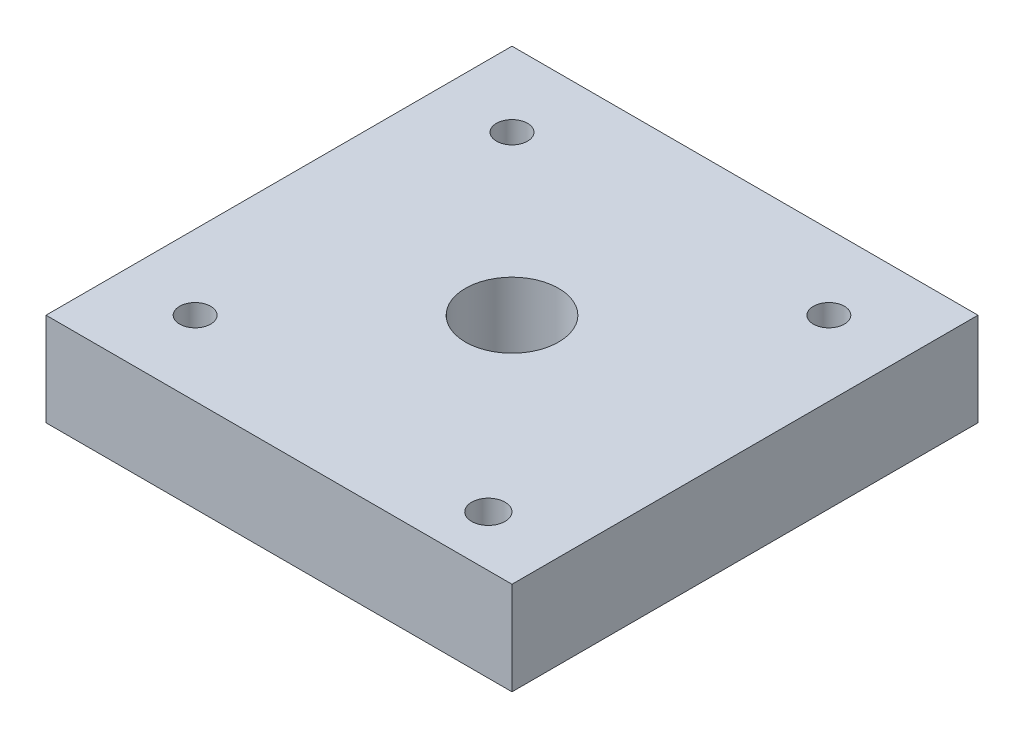
ISO-10303-21;
HEADER;
FILE_DESCRIPTION(('STEP AP214'),'2;1');
FILE_NAME('part.step','',(''),(''),'','','');
FILE_SCHEMA(('AUTOMOTIVE_DESIGN { 1 0 10303 214 1 1 1 1 }'));
ENDSEC;
DATA;
#1=APPLICATION_CONTEXT('core data for automotive mechanical design processes');
#2=APPLICATION_PROTOCOL_DEFINITION('international standard','automotive_design',2000,#1);
#3=PRODUCT_CONTEXT('',#1,'mechanical');
#4=PRODUCT('Part','Part','',(#3));
#5=PRODUCT_RELATED_PRODUCT_CATEGORY('part','',(#4));
#6=PRODUCT_DEFINITION_FORMATION('','',#4);
#7=PRODUCT_DEFINITION_CONTEXT('part definition',#1,'design');
#8=PRODUCT_DEFINITION('design','',#6,#7);
#9=PRODUCT_DEFINITION_SHAPE('','',#8);
#10=(LENGTH_UNIT() NAMED_UNIT(*) SI_UNIT(.MILLI.,.METRE.));
#11=(NAMED_UNIT(*) PLANE_ANGLE_UNIT() SI_UNIT($,.RADIAN.));
#12=(NAMED_UNIT(*) SI_UNIT($,.STERADIAN.) SOLID_ANGLE_UNIT());
#13=UNCERTAINTY_MEASURE_WITH_UNIT(LENGTH_MEASURE(1.E-05),#10,'distance_accuracy_value','');
#14=(GEOMETRIC_REPRESENTATION_CONTEXT(3) GLOBAL_UNCERTAINTY_ASSIGNED_CONTEXT((#13)) GLOBAL_UNIT_ASSIGNED_CONTEXT((#10,
#11,#12)) REPRESENTATION_CONTEXT('',''));
#15=CARTESIAN_POINT('',(0.,0.,0.));
#16=DIRECTION('',(0.,0.,1.));
#17=DIRECTION('',(1.,0.,0.));
#18=AXIS2_PLACEMENT_3D('',#15,#16,#17);
#19=CARTESIAN_POINT('',(0.,10.,0.));
#20=DIRECTION('',(0.,-1.,0.));
#21=DIRECTION('',(0.,0.,-1.));
#22=AXIS2_PLACEMENT_3D('',#19,#20,#21);
#23=PLANE('',#22);
#24=CARTESIAN_POINT('',(-17.,10.,17.));
#25=DIRECTION('',(0.,1.,0.));
#26=DIRECTION('',(0.,0.,1.));
#27=AXIS2_PLACEMENT_3D('',#24,#25,#26);
#28=CIRCLE('',#27,1.666);
#29=CARTESIAN_POINT('',(-17.,10.,18.666));
#30=VERTEX_POINT('',#29);
#31=EDGE_CURVE('E127',#30,#30,#28,.T.);
#32=ORIENTED_EDGE('',*,*,#31,.F.);
#33=EDGE_LOOP('',(#32));
#34=FACE_BOUND('',#33,.T.);
#35=CARTESIAN_POINT('',(-17.,10.,-17.));
#36=DIRECTION('',(0.,1.,0.));
#37=DIRECTION('',(0.,0.,1.));
#38=AXIS2_PLACEMENT_3D('',#35,#36,#37);
#39=CIRCLE('',#38,1.666);
#40=CARTESIAN_POINT('',(-17.,10.,-15.334));
#41=VERTEX_POINT('',#40);
#42=EDGE_CURVE('E115',#41,#41,#39,.T.);
#43=ORIENTED_EDGE('',*,*,#42,.F.);
#44=EDGE_LOOP('',(#43));
#45=FACE_BOUND('',#44,.T.);
#46=DIRECTION('',(0.,0.,-1.));
#47=VECTOR('',#46,1.);
#48=CARTESIAN_POINT('',(25.,10.,25.));
#49=LINE('',#48,#47);
#50=CARTESIAN_POINT('',(25.,10.,25.));
#51=VERTEX_POINT('',#50);
#52=CARTESIAN_POINT('',(25.,10.,-25.));
#53=VERTEX_POINT('',#52);
#54=EDGE_CURVE('E85',#51,#53,#49,.T.);
#55=ORIENTED_EDGE('',*,*,#54,.T.);
#56=DIRECTION('',(-1.,0.,0.));
#57=VECTOR('',#56,1.);
#58=CARTESIAN_POINT('',(-25.,10.,-25.));
#59=LINE('',#58,#57);
#60=CARTESIAN_POINT('',(-25.,10.,-25.));
#61=VERTEX_POINT('',#60);
#62=EDGE_CURVE('E80',#53,#61,#59,.T.);
#63=ORIENTED_EDGE('',*,*,#62,.T.);
#64=DIRECTION('',(0.,0.,1.));
#65=VECTOR('',#64,1.);
#66=CARTESIAN_POINT('',(-25.,10.,25.));
#67=LINE('',#66,#65);
#68=CARTESIAN_POINT('',(-25.,10.,25.));
#69=VERTEX_POINT('',#68);
#70=EDGE_CURVE('E83',#61,#69,#67,.T.);
#71=ORIENTED_EDGE('',*,*,#70,.T.);
#72=DIRECTION('',(1.,0.,0.));
#73=VECTOR('',#72,1.);
#74=CARTESIAN_POINT('',(-25.,10.,25.));
#75=LINE('',#74,#73);
#76=EDGE_CURVE('E50',#69,#51,#75,.T.);
#77=ORIENTED_EDGE('',*,*,#76,.T.);
#78=EDGE_LOOP('',(#55,#63,#71,#77));
#79=FACE_BOUND('',#78,.T.);
#80=CARTESIAN_POINT('',(0.,10.,0.));
#81=DIRECTION('',(0.,1.,0.));
#82=DIRECTION('',(0.,0.,1.));
#83=AXIS2_PLACEMENT_3D('',#80,#81,#82);
#84=CIRCLE('',#83,5.);
#85=CARTESIAN_POINT('',(0.,10.,5.));
#86=VERTEX_POINT('',#85);
#87=EDGE_CURVE('E100',#86,#86,#84,.T.);
#88=ORIENTED_EDGE('',*,*,#87,.F.);
#89=EDGE_LOOP('',(#88));
#90=FACE_BOUND('',#89,.T.);
#91=CARTESIAN_POINT('',(17.,10.,-17.));
#92=DIRECTION('',(0.,1.,0.));
#93=DIRECTION('',(0.,0.,1.));
#94=AXIS2_PLACEMENT_3D('',#91,#92,#93);
#95=CIRCLE('',#94,1.666);
#96=CARTESIAN_POINT('',(17.,10.,-15.334));
#97=VERTEX_POINT('',#96);
#98=EDGE_CURVE('E121',#97,#97,#95,.T.);
#99=ORIENTED_EDGE('',*,*,#98,.F.);
#100=EDGE_LOOP('',(#99));
#101=FACE_BOUND('',#100,.T.);
#102=CARTESIAN_POINT('',(17.,10.,19.5369609036188));
#103=DIRECTION('',(0.,1.,0.));
#104=DIRECTION('',(0.,0.,1.));
#105=AXIS2_PLACEMENT_3D('',#102,#103,#104);
#106=CIRCLE('',#105,1.793902258554);
#107=CARTESIAN_POINT('',(17.,10.,21.3308631621728));
#108=VERTEX_POINT('',#107);
#109=EDGE_CURVE('E133',#108,#108,#106,.T.);
#110=ORIENTED_EDGE('',*,*,#109,.F.);
#111=EDGE_LOOP('',(#110));
#112=FACE_BOUND('',#111,.T.);
#113=ADVANCED_FACE('F33',(#34,#45,#79,#90,#101,#112),#23,.F.);
#114=CARTESIAN_POINT('',(0.,0.,0.));
#115=DIRECTION('',(0.,-1.,0.));
#116=DIRECTION('',(0.,0.,-1.));
#117=AXIS2_PLACEMENT_3D('',#114,#115,#116);
#118=PLANE('',#117);
#119=CARTESIAN_POINT('',(-17.,0.,17.));
#120=DIRECTION('',(0.,1.,0.));
#121=DIRECTION('',(0.,0.,1.));
#122=AXIS2_PLACEMENT_3D('',#119,#120,#121);
#123=CIRCLE('',#122,1.666);
#124=CARTESIAN_POINT('',(-17.,0.,18.666));
#125=VERTEX_POINT('',#124);
#126=EDGE_CURVE('E130',#125,#125,#123,.T.);
#127=ORIENTED_EDGE('',*,*,#126,.T.);
#128=EDGE_LOOP('',(#127));
#129=FACE_BOUND('',#128,.T.);
#130=CARTESIAN_POINT('',(-17.,0.,-17.));
#131=DIRECTION('',(0.,1.,0.));
#132=DIRECTION('',(0.,0.,1.));
#133=AXIS2_PLACEMENT_3D('',#130,#131,#132);
#134=CIRCLE('',#133,1.666);
#135=CARTESIAN_POINT('',(-17.,0.,-15.334));
#136=VERTEX_POINT('',#135);
#137=EDGE_CURVE('E118',#136,#136,#134,.T.);
#138=ORIENTED_EDGE('',*,*,#137,.T.);
#139=EDGE_LOOP('',(#138));
#140=FACE_BOUND('',#139,.T.);
#141=DIRECTION('',(0.,0.,-1.));
#142=VECTOR('',#141,1.);
#143=CARTESIAN_POINT('',(25.,0.,25.));
#144=LINE('',#143,#142);
#145=CARTESIAN_POINT('',(25.,0.,25.));
#146=VERTEX_POINT('',#145);
#147=CARTESIAN_POINT('',(25.,0.,-25.));
#148=VERTEX_POINT('',#147);
#149=EDGE_CURVE('E97',#146,#148,#144,.T.);
#150=ORIENTED_EDGE('',*,*,#149,.F.);
#151=DIRECTION('',(1.,0.,0.));
#152=VECTOR('',#151,1.);
#153=CARTESIAN_POINT('',(-25.,0.,25.));
#154=LINE('',#153,#152);
#155=CARTESIAN_POINT('',(-25.,0.,25.));
#156=VERTEX_POINT('',#155);
#157=EDGE_CURVE('E73',#156,#146,#154,.T.);
#158=ORIENTED_EDGE('',*,*,#157,.F.);
#159=DIRECTION('',(0.,0.,1.));
#160=VECTOR('',#159,1.);
#161=CARTESIAN_POINT('',(-25.,0.,25.));
#162=LINE('',#161,#160);
#163=CARTESIAN_POINT('',(-25.,0.,-25.));
#164=VERTEX_POINT('',#163);
#165=EDGE_CURVE('E67',#164,#156,#162,.T.);
#166=ORIENTED_EDGE('',*,*,#165,.F.);
#167=DIRECTION('',(-1.,0.,0.));
#168=VECTOR('',#167,1.);
#169=CARTESIAN_POINT('',(-25.,0.,-25.));
#170=LINE('',#169,#168);
#171=EDGE_CURVE('E89',#148,#164,#170,.T.);
#172=ORIENTED_EDGE('',*,*,#171,.F.);
#173=EDGE_LOOP('',(#150,#158,#166,#172));
#174=FACE_BOUND('',#173,.T.);
#175=CARTESIAN_POINT('',(0.,0.,0.));
#176=DIRECTION('',(0.,1.,0.));
#177=DIRECTION('',(0.,0.,1.));
#178=AXIS2_PLACEMENT_3D('',#175,#176,#177);
#179=CIRCLE('',#178,5.);
#180=CARTESIAN_POINT('',(0.,0.,5.));
#181=VERTEX_POINT('',#180);
#182=EDGE_CURVE('E112',#181,#181,#179,.T.);
#183=ORIENTED_EDGE('',*,*,#182,.T.);
#184=EDGE_LOOP('',(#183));
#185=FACE_BOUND('',#184,.T.);
#186=CARTESIAN_POINT('',(17.,0.,-17.));
#187=DIRECTION('',(0.,1.,0.));
#188=DIRECTION('',(0.,0.,1.));
#189=AXIS2_PLACEMENT_3D('',#186,#187,#188);
#190=CIRCLE('',#189,1.666);
#191=CARTESIAN_POINT('',(17.,0.,-15.334));
#192=VERTEX_POINT('',#191);
#193=EDGE_CURVE('E124',#192,#192,#190,.T.);
#194=ORIENTED_EDGE('',*,*,#193,.T.);
#195=EDGE_LOOP('',(#194));
#196=FACE_BOUND('',#195,.T.);
#197=CARTESIAN_POINT('',(17.,0.,19.5369609036188));
#198=DIRECTION('',(0.,1.,0.));
#199=DIRECTION('',(0.,0.,1.));
#200=AXIS2_PLACEMENT_3D('',#197,#198,#199);
#201=CIRCLE('',#200,1.793902258554);
#202=CARTESIAN_POINT('',(17.,0.,21.3308631621728));
#203=VERTEX_POINT('',#202);
#204=EDGE_CURVE('E136',#203,#203,#201,.T.);
#205=ORIENTED_EDGE('',*,*,#204,.T.);
#206=EDGE_LOOP('',(#205));
#207=FACE_BOUND('',#206,.T.);
#208=ADVANCED_FACE('F108',(#129,#140,#174,#185,#196,#207),#118,.T.);
#209=CARTESIAN_POINT('',(25.,10.,25.));
#210=DIRECTION('',(-1.,0.,0.));
#211=DIRECTION('',(0.,0.,1.));
#212=AXIS2_PLACEMENT_3D('',#209,#210,#211);
#213=PLANE('',#212);
#214=ORIENTED_EDGE('',*,*,#149,.T.);
#215=DIRECTION('',(0.,-1.,0.));
#216=VECTOR('',#215,1.);
#217=CARTESIAN_POINT('',(25.,10.,-25.));
#218=LINE('',#217,#216);
#219=EDGE_CURVE('E11',#53,#148,#218,.T.);
#220=ORIENTED_EDGE('',*,*,#219,.F.);
#221=ORIENTED_EDGE('',*,*,#54,.F.);
#222=DIRECTION('',(0.,-1.,0.));
#223=VECTOR('',#222,1.);
#224=CARTESIAN_POINT('',(25.,10.,25.));
#225=LINE('',#224,#223);
#226=EDGE_CURVE('E93',#51,#146,#225,.T.);
#227=ORIENTED_EDGE('',*,*,#226,.T.);
#228=EDGE_LOOP('',(#214,#220,#221,#227));
#229=FACE_BOUND('',#228,.T.);
#230=ADVANCED_FACE('F35',(#229),#213,.F.);
#231=CARTESIAN_POINT('',(-25.,10.,-25.));
#232=DIRECTION('',(0.,0.,1.));
#233=DIRECTION('',(1.,0.,0.));
#234=AXIS2_PLACEMENT_3D('',#231,#232,#233);
#235=PLANE('',#234);
#236=ORIENTED_EDGE('',*,*,#171,.T.);
#237=DIRECTION('',(0.,-1.,0.));
#238=VECTOR('',#237,1.);
#239=CARTESIAN_POINT('',(-25.,10.,-25.));
#240=LINE('',#239,#238);
#241=EDGE_CURVE('E42',#61,#164,#240,.T.);
#242=ORIENTED_EDGE('',*,*,#241,.F.);
#243=ORIENTED_EDGE('',*,*,#62,.F.);
#244=ORIENTED_EDGE('',*,*,#219,.T.);
#245=EDGE_LOOP('',(#236,#242,#243,#244));
#246=FACE_BOUND('',#245,.T.);
#247=ADVANCED_FACE('F88',(#246),#235,.F.);
#248=CARTESIAN_POINT('',(-25.,10.,25.));
#249=DIRECTION('',(1.,0.,0.));
#250=DIRECTION('',(0.,0.,-1.));
#251=AXIS2_PLACEMENT_3D('',#248,#249,#250);
#252=PLANE('',#251);
#253=ORIENTED_EDGE('',*,*,#165,.T.);
#254=DIRECTION('',(0.,-1.,0.));
#255=VECTOR('',#254,1.);
#256=CARTESIAN_POINT('',(-25.,10.,25.));
#257=LINE('',#256,#255);
#258=EDGE_CURVE('E90',#69,#156,#257,.T.);
#259=ORIENTED_EDGE('',*,*,#258,.F.);
#260=ORIENTED_EDGE('',*,*,#70,.F.);
#261=ORIENTED_EDGE('',*,*,#241,.T.);
#262=EDGE_LOOP('',(#253,#259,#260,#261));
#263=FACE_BOUND('',#262,.T.);
#264=ADVANCED_FACE('F91',(#263),#252,.F.);
#265=CARTESIAN_POINT('',(-25.,10.,25.));
#266=DIRECTION('',(0.,0.,-1.));
#267=DIRECTION('',(-1.,0.,0.));
#268=AXIS2_PLACEMENT_3D('',#265,#266,#267);
#269=PLANE('',#268);
#270=ORIENTED_EDGE('',*,*,#157,.T.);
#271=ORIENTED_EDGE('',*,*,#226,.F.);
#272=ORIENTED_EDGE('',*,*,#76,.F.);
#273=ORIENTED_EDGE('',*,*,#258,.T.);
#274=EDGE_LOOP('',(#270,#271,#272,#273));
#275=FACE_BOUND('',#274,.T.);
#276=ADVANCED_FACE('F105',(#275),#269,.F.);
#277=CARTESIAN_POINT('',(0.,10.,0.));
#278=DIRECTION('',(0.,-1.,0.));
#279=DIRECTION('',(0.,0.,-1.));
#280=AXIS2_PLACEMENT_3D('',#277,#278,#279);
#281=CYLINDRICAL_SURFACE('',#280,5.);
#282=ORIENTED_EDGE('',*,*,#87,.T.);
#283=EDGE_LOOP('',(#282));
#284=FACE_BOUND('',#283,.T.);
#285=ORIENTED_EDGE('',*,*,#182,.F.);
#286=EDGE_LOOP('',(#285));
#287=FACE_BOUND('',#286,.T.);
#288=ADVANCED_FACE('F156',(#284,#287),#281,.F.);
#289=CARTESIAN_POINT('',(-17.,10.,-17.));
#290=DIRECTION('',(0.,-1.,0.));
#291=DIRECTION('',(0.,0.,-1.));
#292=AXIS2_PLACEMENT_3D('',#289,#290,#291);
#293=CYLINDRICAL_SURFACE('',#292,1.666);
#294=ORIENTED_EDGE('',*,*,#42,.T.);
#295=EDGE_LOOP('',(#294));
#296=FACE_BOUND('',#295,.T.);
#297=ORIENTED_EDGE('',*,*,#137,.F.);
#298=EDGE_LOOP('',(#297));
#299=FACE_BOUND('',#298,.T.);
#300=ADVANCED_FACE('F202',(#296,#299),#293,.F.);
#301=CARTESIAN_POINT('',(17.,10.,-17.));
#302=DIRECTION('',(0.,-1.,0.));
#303=DIRECTION('',(0.,0.,-1.));
#304=AXIS2_PLACEMENT_3D('',#301,#302,#303);
#305=CYLINDRICAL_SURFACE('',#304,1.666);
#306=ORIENTED_EDGE('',*,*,#98,.T.);
#307=EDGE_LOOP('',(#306));
#308=FACE_BOUND('',#307,.T.);
#309=ORIENTED_EDGE('',*,*,#193,.F.);
#310=EDGE_LOOP('',(#309));
#311=FACE_BOUND('',#310,.T.);
#312=ADVANCED_FACE('F210',(#308,#311),#305,.F.);
#313=CARTESIAN_POINT('',(-17.,10.,17.));
#314=DIRECTION('',(0.,-1.,0.));
#315=DIRECTION('',(0.,0.,-1.));
#316=AXIS2_PLACEMENT_3D('',#313,#314,#315);
#317=CYLINDRICAL_SURFACE('',#316,1.666);
#318=ORIENTED_EDGE('',*,*,#31,.T.);
#319=EDGE_LOOP('',(#318));
#320=FACE_BOUND('',#319,.T.);
#321=ORIENTED_EDGE('',*,*,#126,.F.);
#322=EDGE_LOOP('',(#321));
#323=FACE_BOUND('',#322,.T.);
#324=ADVANCED_FACE('F218',(#320,#323),#317,.F.);
#325=CARTESIAN_POINT('',(17.,10.,19.5369609036188));
#326=DIRECTION('',(0.,-1.,0.));
#327=DIRECTION('',(0.,0.,-1.));
#328=AXIS2_PLACEMENT_3D('',#325,#326,#327);
#329=CYLINDRICAL_SURFACE('',#328,1.793902258554);
#330=ORIENTED_EDGE('',*,*,#109,.T.);
#331=EDGE_LOOP('',(#330));
#332=FACE_BOUND('',#331,.T.);
#333=ORIENTED_EDGE('',*,*,#204,.F.);
#334=EDGE_LOOP('',(#333));
#335=FACE_BOUND('',#334,.T.);
#336=ADVANCED_FACE('F142',(#332,#335),#329,.F.);
#337=CLOSED_SHELL('',(#113,#208,#230,#247,#264,#276,#288,#300,#312,#324,#336));
#338=MANIFOLD_SOLID_BREP('B2',#337);
#339=ADVANCED_BREP_SHAPE_REPRESENTATION('',(#18,#338),#14);
#340=SHAPE_DEFINITION_REPRESENTATION(#9,#339);
ENDSEC;
END-ISO-10303-21;
